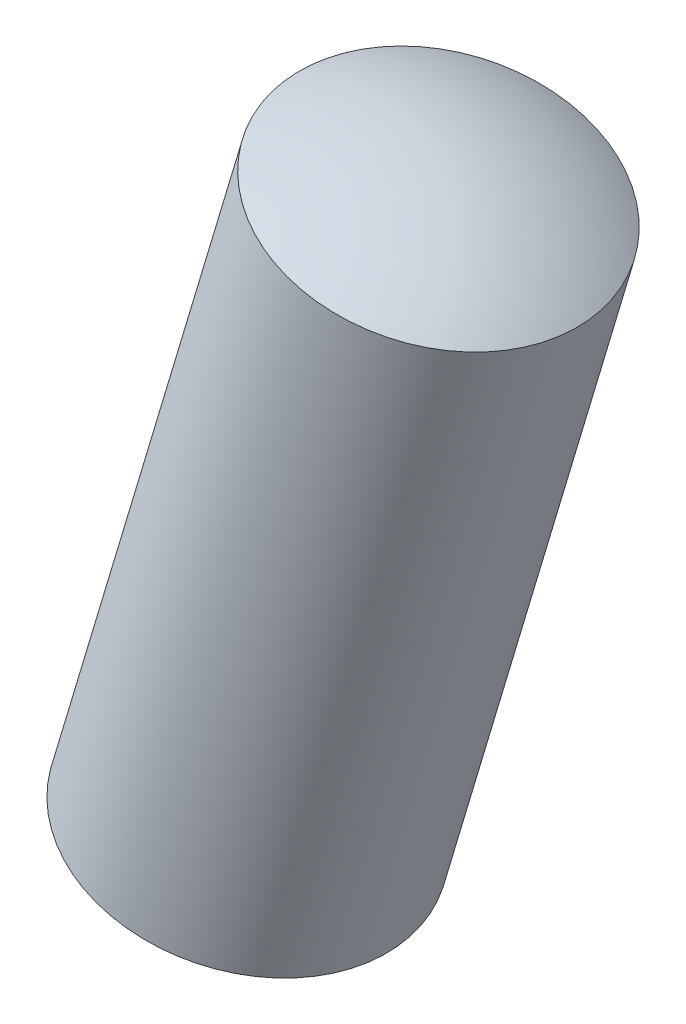
ISO-10303-21;
HEADER;
FILE_DESCRIPTION(('STEP AP214'),'2;1');
FILE_NAME('part.step','',(''),(''),'','','');
FILE_SCHEMA(('AUTOMOTIVE_DESIGN { 1 0 10303 214 1 1 1 1 }'));
ENDSEC;
DATA;
#1=APPLICATION_CONTEXT('core data for automotive mechanical design processes');
#2=APPLICATION_PROTOCOL_DEFINITION('international standard','automotive_design',2000,#1);
#3=PRODUCT_CONTEXT('',#1,'mechanical');
#4=PRODUCT('Part','Part','',(#3));
#5=PRODUCT_RELATED_PRODUCT_CATEGORY('part','',(#4));
#6=PRODUCT_DEFINITION_FORMATION('','',#4);
#7=PRODUCT_DEFINITION_CONTEXT('part definition',#1,'design');
#8=PRODUCT_DEFINITION('design','',#6,#7);
#9=PRODUCT_DEFINITION_SHAPE('','',#8);
#10=(LENGTH_UNIT() NAMED_UNIT(*) SI_UNIT(.MILLI.,.METRE.));
#11=(NAMED_UNIT(*) PLANE_ANGLE_UNIT() SI_UNIT($,.RADIAN.));
#12=(NAMED_UNIT(*) SI_UNIT($,.STERADIAN.) SOLID_ANGLE_UNIT());
#13=UNCERTAINTY_MEASURE_WITH_UNIT(LENGTH_MEASURE(1.E-05),#10,'distance_accuracy_value','');
#14=(GEOMETRIC_REPRESENTATION_CONTEXT(3) GLOBAL_UNCERTAINTY_ASSIGNED_CONTEXT((#13)) GLOBAL_UNIT_ASSIGNED_CONTEXT((#10,
#11,#12)) REPRESENTATION_CONTEXT('',''));
#15=CARTESIAN_POINT('',(0.,0.,0.));
#16=DIRECTION('',(0.,0.,1.));
#17=DIRECTION('',(1.,0.,0.));
#18=AXIS2_PLACEMENT_3D('',#15,#16,#17);
#19=CARTESIAN_POINT('',(-6.39658560194275,-21.3764214568536,0.6));
#20=DIRECTION('',(-0.958027613136178,0.286675936326365,0.));
#21=DIRECTION('',(-0.286675936326365,-0.958027613136178,0.));
#22=AXIS2_PLACEMENT_3D('',#19,#20,#21);
#23=SPHERICAL_SURFACE('',#22,2.);
#24=CARTESIAN_POINT('',(-6.39658560194275,-21.3764214568536,0.6));
#25=DIRECTION('',(0.286675936326365,0.958027613136178,0.));
#26=DIRECTION('',(0.,0.,-1.));
#27=AXIS2_PLACEMENT_3D('',#24,#25,#26);
#28=SPHERICAL_SURFACE('',#27,2.);
#29=CARTESIAN_POINT('',(-6.89312288896742,-23.0357739578594,0.599999999999989));
#30=DIRECTION('',(0.286675936326365,0.958027613136178,0.));
#31=DIRECTION('',(0.,0.,-1.));
#32=AXIS2_PLACEMENT_3D('',#29,#30,#31);
#33=CIRCLE('',#32,1.);
#34=CARTESIAN_POINT('',(-6.89312288896742,-23.0357739578594,-0.400000000000011));
#35=VERTEX_POINT('',#34);
#36=EDGE_CURVE('E11',#35,#35,#33,.T.);
#37=ORIENTED_EDGE('',*,*,#36,.F.);
#38=EDGE_LOOP('',(#37));
#39=FACE_BOUND('',#38,.T.);
#40=ADVANCED_FACE('F17',(#39),#28,.T.);
#41=CARTESIAN_POINT('',(-6.07381762825406,-20.2977797145701,0.599999999999989));
#42=DIRECTION('',(-0.958027613136178,0.286675936326365,0.));
#43=DIRECTION('',(0.286675936326365,0.958027613136178,0.));
#44=AXIS2_PLACEMENT_3D('',#41,#42,#43);
#45=SPHERICAL_SURFACE('',#44,2.);
#46=CARTESIAN_POINT('',(-6.07381762825406,-20.2977797145701,0.599999999999989));
#47=DIRECTION('',(0.286675936326365,0.958027613136178,0.));
#48=DIRECTION('',(0.,0.,-1.));
#49=AXIS2_PLACEMENT_3D('',#46,#47,#48);
#50=SPHERICAL_SURFACE('',#49,2.);
#51=CARTESIAN_POINT('',(-5.57728034122946,-18.6384272135643,0.599999999999989));
#52=DIRECTION('',(0.286675936326365,0.958027613136178,0.));
#53=DIRECTION('',(0.,0.,-1.));
#54=AXIS2_PLACEMENT_3D('',#51,#52,#53);
#55=CIRCLE('',#54,1.);
#56=CARTESIAN_POINT('',(-5.57728034122946,-18.6384272135643,-0.400000000000011));
#57=VERTEX_POINT('',#56);
#58=EDGE_CURVE('E21',#57,#57,#55,.T.);
#59=ORIENTED_EDGE('',*,*,#58,.T.);
#60=EDGE_LOOP('',(#59));
#61=FACE_BOUND('',#60,.T.);
#62=ADVANCED_FACE('F19',(#61),#50,.T.);
#63=CARTESIAN_POINT('',(-5.90624097816393,-19.7377638996381,0.599999999999989));
#64=DIRECTION('',(0.286675936326365,0.958027613136178,0.));
#65=DIRECTION('',(0.,0.,-1.));
#66=AXIS2_PLACEMENT_3D('',#63,#64,#65);
#67=CYLINDRICAL_SURFACE('',#66,1.);
#68=ORIENTED_EDGE('',*,*,#36,.T.);
#69=EDGE_LOOP('',(#68));
#70=FACE_BOUND('',#69,.T.);
#71=ORIENTED_EDGE('',*,*,#58,.F.);
#72=EDGE_LOOP('',(#71));
#73=FACE_BOUND('',#72,.T.);
#74=ADVANCED_FACE('F57',(#70,#73),#67,.T.);
#75=CLOSED_SHELL('',(#40,#62,#74));
#76=MANIFOLD_SOLID_BREP('B1',#75);
#77=ADVANCED_BREP_SHAPE_REPRESENTATION('',(#18,#76),#14);
#78=SHAPE_DEFINITION_REPRESENTATION(#9,#77);
ENDSEC;
END-ISO-10303-21;
